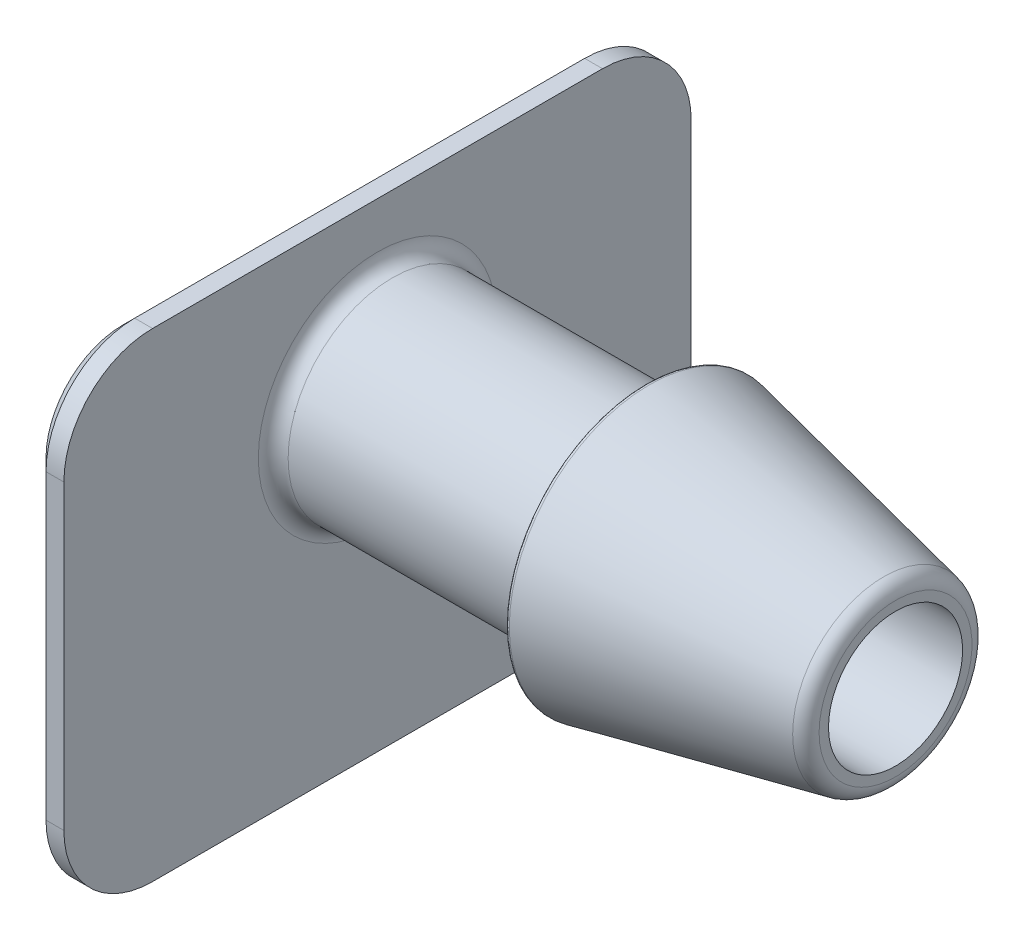
ISO-10303-21;
HEADER;
FILE_DESCRIPTION(('STEP AP214'),'2;1');
FILE_NAME('part.step','',(''),(''),'','','');
FILE_SCHEMA(('AUTOMOTIVE_DESIGN { 1 0 10303 214 1 1 1 1 }'));
ENDSEC;
DATA;
#1=APPLICATION_CONTEXT('core data for automotive mechanical design processes');
#2=APPLICATION_PROTOCOL_DEFINITION('international standard','automotive_design',2000,#1);
#3=PRODUCT_CONTEXT('',#1,'mechanical');
#4=PRODUCT('Part','Part','',(#3));
#5=PRODUCT_RELATED_PRODUCT_CATEGORY('part','',(#4));
#6=PRODUCT_DEFINITION_FORMATION('','',#4);
#7=PRODUCT_DEFINITION_CONTEXT('part definition',#1,'design');
#8=PRODUCT_DEFINITION('design','',#6,#7);
#9=PRODUCT_DEFINITION_SHAPE('','',#8);
#10=(LENGTH_UNIT() NAMED_UNIT(*) SI_UNIT(.MILLI.,.METRE.));
#11=(NAMED_UNIT(*) PLANE_ANGLE_UNIT() SI_UNIT($,.RADIAN.));
#12=(NAMED_UNIT(*) SI_UNIT($,.STERADIAN.) SOLID_ANGLE_UNIT());
#13=UNCERTAINTY_MEASURE_WITH_UNIT(LENGTH_MEASURE(1.E-05),#10,'distance_accuracy_value','');
#14=(GEOMETRIC_REPRESENTATION_CONTEXT(3) GLOBAL_UNCERTAINTY_ASSIGNED_CONTEXT((#13)) GLOBAL_UNIT_ASSIGNED_CONTEXT((#10,
#11,#12)) REPRESENTATION_CONTEXT('',''));
#15=CARTESIAN_POINT('',(0.,0.,0.));
#16=DIRECTION('',(0.,0.,1.));
#17=DIRECTION('',(1.,0.,0.));
#18=AXIS2_PLACEMENT_3D('',#15,#16,#17);
#19=CARTESIAN_POINT('',(1.80625,2.75,0.));
#20=DIRECTION('',(1.,0.,0.));
#21=DIRECTION('',(0.,0.,-1.));
#22=AXIS2_PLACEMENT_3D('',#19,#20,#21);
#23=PLANE('',#22);
#24=CARTESIAN_POINT('',(1.80625,-3.7747,-3.7747));
#25=DIRECTION('',(1.,0.,0.));
#26=DIRECTION('',(0.,0.,-1.));
#27=AXIS2_PLACEMENT_3D('',#24,#25,#26);
#28=CIRCLE('',#27,1.2875);
#29=CARTESIAN_POINT('',(1.80625,-3.77469999999999,-5.0622));
#30=VERTEX_POINT('',#29);
#31=CARTESIAN_POINT('',(1.80625,-5.0622,-3.77469999999999));
#32=VERTEX_POINT('',#31);
#33=EDGE_CURVE('E211',#30,#32,#28,.F.);
#34=ORIENTED_EDGE('',*,*,#33,.T.);
#35=DIRECTION('',(0.,0.,1.));
#36=VECTOR('',#35,1.);
#37=CARTESIAN_POINT('',(1.80625,-5.0622,3.77469999999999));
#38=LINE('',#37,#36);
#39=CARTESIAN_POINT('',(1.80625,-5.0622,3.77469999999999));
#40=VERTEX_POINT('',#39);
#41=EDGE_CURVE('E215',#32,#40,#38,.T.);
#42=ORIENTED_EDGE('',*,*,#41,.T.);
#43=CARTESIAN_POINT('',(1.80625,-3.7747,3.7747));
#44=DIRECTION('',(1.,0.,0.));
#45=DIRECTION('',(0.,0.,-1.));
#46=AXIS2_PLACEMENT_3D('',#43,#44,#45);
#47=CIRCLE('',#46,1.2875);
#48=CARTESIAN_POINT('',(1.80625,-3.77469999999999,5.0622));
#49=VERTEX_POINT('',#48);
#50=EDGE_CURVE('E213',#40,#49,#47,.F.);
#51=ORIENTED_EDGE('',*,*,#50,.T.);
#52=DIRECTION('',(0.,1.,0.));
#53=VECTOR('',#52,1.);
#54=CARTESIAN_POINT('',(1.80625,1.28749999999999,5.0622));
#55=LINE('',#54,#53);
#56=CARTESIAN_POINT('',(1.80625,1.28749999999999,5.0622));
#57=VERTEX_POINT('',#56);
#58=EDGE_CURVE('E209',#49,#57,#55,.T.);
#59=ORIENTED_EDGE('',*,*,#58,.T.);
#60=CARTESIAN_POINT('',(1.80625,1.2875,3.7747));
#61=DIRECTION('',(1.,0.,0.));
#62=DIRECTION('',(0.,0.,-1.));
#63=AXIS2_PLACEMENT_3D('',#60,#61,#62);
#64=CIRCLE('',#63,1.2875);
#65=CARTESIAN_POINT('',(1.80625,2.575,3.77469999999999));
#66=VERTEX_POINT('',#65);
#67=EDGE_CURVE('E205',#57,#66,#64,.F.);
#68=ORIENTED_EDGE('',*,*,#67,.T.);
#69=DIRECTION('',(0.,0.,-1.));
#70=VECTOR('',#69,1.);
#71=CARTESIAN_POINT('',(1.80625,2.575,-3.77469999999999));
#72=LINE('',#71,#70);
#73=CARTESIAN_POINT('',(1.80625,2.575,-3.77469999999999));
#74=VERTEX_POINT('',#73);
#75=EDGE_CURVE('E201',#66,#74,#72,.T.);
#76=ORIENTED_EDGE('',*,*,#75,.T.);
#77=CARTESIAN_POINT('',(1.80625,1.2875,-3.7747));
#78=DIRECTION('',(1.,0.,0.));
#79=DIRECTION('',(0.,0.,-1.));
#80=AXIS2_PLACEMENT_3D('',#77,#78,#79);
#81=CIRCLE('',#80,1.2875);
#82=CARTESIAN_POINT('',(1.80625,1.28749999999999,-5.0622));
#83=VERTEX_POINT('',#82);
#84=EDGE_CURVE('E203',#74,#83,#81,.F.);
#85=ORIENTED_EDGE('',*,*,#84,.T.);
#86=DIRECTION('',(0.,-1.,0.));
#87=VECTOR('',#86,1.);
#88=CARTESIAN_POINT('',(1.80625,-3.7747,-5.0622));
#89=LINE('',#88,#87);
#90=EDGE_CURVE('E207',#83,#30,#89,.T.);
#91=ORIENTED_EDGE('',*,*,#90,.T.);
#92=EDGE_LOOP('',(#34,#42,#51,#59,#68,#76,#85,#91));
#93=FACE_BOUND('',#92,.T.);
#94=CARTESIAN_POINT('',(1.80625,0.,0.));
#95=DIRECTION('',(-1.,0.,0.));
#96=DIRECTION('',(0.,0.,1.));
#97=AXIS2_PLACEMENT_3D('',#94,#95,#96);
#98=CIRCLE('',#97,1.49176203549763);
#99=CARTESIAN_POINT('',(1.80625,0.,1.49176203549763));
#100=VERTEX_POINT('',#99);
#101=EDGE_CURVE('E198',#100,#100,#98,.T.);
#102=ORIENTED_EDGE('',*,*,#101,.F.);
#103=EDGE_LOOP('',(#102));
#104=FACE_BOUND('',#103,.T.);
#105=ADVANCED_FACE('F30',(#93,#104),#23,.F.);
#106=CARTESIAN_POINT('',(1.80625,0.,0.));
#107=DIRECTION('',(-1.,0.,0.));
#108=DIRECTION('',(0.,0.,1.));
#109=AXIS2_PLACEMENT_3D('',#106,#107,#108);
#110=CONICAL_SURFACE('',#109,1.49176203549763,0.349065850398867);
#111=CARTESIAN_POINT('',(2.81392041084295,0.,0.));
#112=DIRECTION('',(-1.,0.,0.));
#113=DIRECTION('',(0.,0.,1.));
#114=AXIS2_PLACEMENT_3D('',#111,#112,#113);
#115=CIRCLE('',#114,1.125);
#116=CARTESIAN_POINT('',(2.81392041084295,0.,1.125));
#117=VERTEX_POINT('',#116);
#118=EDGE_CURVE('E195',#117,#117,#115,.T.);
#119=ORIENTED_EDGE('',*,*,#118,.F.);
#120=EDGE_LOOP('',(#119));
#121=FACE_BOUND('',#120,.T.);
#122=ORIENTED_EDGE('',*,*,#101,.T.);
#123=EDGE_LOOP('',(#122));
#124=FACE_BOUND('',#123,.T.);
#125=ADVANCED_FACE('F309',(#121,#124),#110,.F.);
#126=CARTESIAN_POINT('',(0.,0.,0.));
#127=DIRECTION('',(-1.,0.,0.));
#128=DIRECTION('',(0.,0.,1.));
#129=AXIS2_PLACEMENT_3D('',#126,#127,#128);
#130=CYLINDRICAL_SURFACE('',#129,1.125);
#131=CARTESIAN_POINT('',(10.99725,0.,0.));
#132=DIRECTION('',(-1.,0.,0.));
#133=DIRECTION('',(0.,0.,1.));
#134=AXIS2_PLACEMENT_3D('',#131,#132,#133);
#135=CIRCLE('',#134,1.125);
#136=CARTESIAN_POINT('',(10.99725,0.,1.125));
#137=VERTEX_POINT('',#136);
#138=EDGE_CURVE('E192',#137,#137,#135,.T.);
#139=ORIENTED_EDGE('',*,*,#138,.F.);
#140=EDGE_LOOP('',(#139));
#141=FACE_BOUND('',#140,.T.);
#142=ORIENTED_EDGE('',*,*,#118,.T.);
#143=EDGE_LOOP('',(#142));
#144=FACE_BOUND('',#143,.T.);
#145=ADVANCED_FACE('F316',(#141,#144),#130,.F.);
#146=CARTESIAN_POINT('',(10.99725,1.125,0.));
#147=DIRECTION('',(-1.,0.,0.));
#148=DIRECTION('',(0.,0.,1.));
#149=AXIS2_PLACEMENT_3D('',#146,#147,#148);
#150=PLANE('',#149);
#151=CARTESIAN_POINT('',(10.99725,0.,0.));
#152=DIRECTION('',(-1.,0.,0.));
#153=DIRECTION('',(0.,0.,1.));
#154=AXIS2_PLACEMENT_3D('',#151,#152,#153);
#155=CIRCLE('',#154,1.2827663099365);
#156=CARTESIAN_POINT('',(10.99725,0.,1.2827663099365));
#157=VERTEX_POINT('',#156);
#158=EDGE_CURVE('E189',#157,#157,#155,.T.);
#159=ORIENTED_EDGE('',*,*,#158,.F.);
#160=EDGE_LOOP('',(#159));
#161=FACE_BOUND('',#160,.T.);
#162=ORIENTED_EDGE('',*,*,#138,.T.);
#163=EDGE_LOOP('',(#162));
#164=FACE_BOUND('',#163,.T.);
#165=ADVANCED_FACE('F461',(#161,#164),#150,.F.);
#166=CARTESIAN_POINT('',(10.74725,0.,0.));
#167=DIRECTION('',(-1.,0.,0.));
#168=DIRECTION('',(0.,0.,1.));
#169=AXIS2_PLACEMENT_3D('',#166,#167,#168);
#170=TOROIDAL_SURFACE('',#169,1.2827663099365,0.25);
#171=CARTESIAN_POINT('',(10.7984162234429,0.,0.));
#172=DIRECTION('',(-1.,0.,0.));
#173=DIRECTION('',(0.,0.,1.));
#174=AXIS2_PLACEMENT_3D('',#171,#172,#173);
#175=CIRCLE('',#174,1.5274743350983);
#176=CARTESIAN_POINT('',(10.7984162234429,0.,1.5274743350983));
#177=VERTEX_POINT('',#176);
#178=EDGE_CURVE('E186',#177,#177,#175,.T.);
#179=ORIENTED_EDGE('',*,*,#178,.F.);
#180=EDGE_LOOP('',(#179));
#181=FACE_BOUND('',#180,.T.);
#182=ORIENTED_EDGE('',*,*,#158,.T.);
#183=EDGE_LOOP('',(#182));
#184=FACE_BOUND('',#183,.T.);
#185=ADVANCED_FACE('F468',(#181,#184),#170,.T.);
#186=CARTESIAN_POINT('',(10.7984162234429,0.,0.));
#187=DIRECTION('',(-1.,0.,0.));
#188=DIRECTION('',(0.,0.,1.));
#189=AXIS2_PLACEMENT_3D('',#186,#187,#188);
#190=CONICAL_SURFACE('',#189,1.5274743350983,0.206121341875306);
#191=CARTESIAN_POINT('',(6.86648324468858,0.,0.));
#192=DIRECTION('',(-1.,0.,0.));
#193=DIRECTION('',(0.,0.,1.));
#194=AXIS2_PLACEMENT_3D('',#191,#192,#193);
#195=CIRCLE('',#194,2.34960577611056);
#196=CARTESIAN_POINT('',(6.86648324468858,0.,2.34960577611056));
#197=VERTEX_POINT('',#196);
#198=EDGE_CURVE('E183',#197,#197,#195,.T.);
#199=ORIENTED_EDGE('',*,*,#198,.F.);
#200=EDGE_LOOP('',(#199));
#201=FACE_BOUND('',#200,.T.);
#202=ORIENTED_EDGE('',*,*,#178,.T.);
#203=EDGE_LOOP('',(#202));
#204=FACE_BOUND('',#203,.T.);
#205=ADVANCED_FACE('F476',(#201,#204),#190,.T.);
#206=CARTESIAN_POINT('',(6.85625,0.,0.));
#207=DIRECTION('',(-1.,0.,0.));
#208=DIRECTION('',(0.,0.,1.));
#209=AXIS2_PLACEMENT_3D('',#206,#207,#208);
#210=TOROIDAL_SURFACE('',#209,2.3006641710782,0.0499999999999998);
#211=CARTESIAN_POINT('',(6.80625,0.,0.));
#212=DIRECTION('',(-1.,0.,0.));
#213=DIRECTION('',(0.,0.,1.));
#214=AXIS2_PLACEMENT_3D('',#211,#212,#213);
#215=CIRCLE('',#214,2.3006641710782);
#216=CARTESIAN_POINT('',(6.80625,0.,2.3006641710782));
#217=VERTEX_POINT('',#216);
#218=EDGE_CURVE('E180',#217,#217,#215,.T.);
#219=ORIENTED_EDGE('',*,*,#218,.F.);
#220=EDGE_LOOP('',(#219));
#221=FACE_BOUND('',#220,.T.);
#222=ORIENTED_EDGE('',*,*,#198,.T.);
#223=EDGE_LOOP('',(#222));
#224=FACE_BOUND('',#223,.T.);
#225=ADVANCED_FACE('F484',(#221,#224),#210,.T.);
#226=CARTESIAN_POINT('',(6.80625,2.3006641710782,0.));
#227=DIRECTION('',(1.,0.,0.));
#228=DIRECTION('',(0.,0.,-1.));
#229=AXIS2_PLACEMENT_3D('',#226,#227,#228);
#230=PLANE('',#229);
#231=CARTESIAN_POINT('',(6.80625,0.,0.));
#232=DIRECTION('',(-1.,0.,0.));
#233=DIRECTION('',(0.,0.,1.));
#234=AXIS2_PLACEMENT_3D('',#231,#232,#233);
#235=CIRCLE('',#234,2.);
#236=CARTESIAN_POINT('',(6.80625,0.,2.));
#237=VERTEX_POINT('',#236);
#238=EDGE_CURVE('E177',#237,#237,#235,.T.);
#239=ORIENTED_EDGE('',*,*,#238,.F.);
#240=EDGE_LOOP('',(#239));
#241=FACE_BOUND('',#240,.T.);
#242=ORIENTED_EDGE('',*,*,#218,.T.);
#243=EDGE_LOOP('',(#242));
#244=FACE_BOUND('',#243,.T.);
#245=ADVANCED_FACE('F492',(#241,#244),#230,.F.);
#246=CARTESIAN_POINT('',(6.55625,0.,0.));
#247=DIRECTION('',(-1.,0.,0.));
#248=DIRECTION('',(0.,0.,1.));
#249=AXIS2_PLACEMENT_3D('',#246,#247,#248);
#250=TOROIDAL_SURFACE('',#249,2.,0.25);
#251=CARTESIAN_POINT('',(6.55625,0.,0.));
#252=DIRECTION('',(-1.,0.,0.));
#253=DIRECTION('',(0.,0.,1.));
#254=AXIS2_PLACEMENT_3D('',#251,#252,#253);
#255=CIRCLE('',#254,1.75);
#256=CARTESIAN_POINT('',(6.55625,0.,1.75));
#257=VERTEX_POINT('',#256);
#258=EDGE_CURVE('E174',#257,#257,#255,.T.);
#259=ORIENTED_EDGE('',*,*,#258,.F.);
#260=EDGE_LOOP('',(#259));
#261=FACE_BOUND('',#260,.T.);
#262=ORIENTED_EDGE('',*,*,#238,.T.);
#263=EDGE_LOOP('',(#262));
#264=FACE_BOUND('',#263,.T.);
#265=ADVANCED_FACE('F500',(#261,#264),#250,.F.);
#266=CARTESIAN_POINT('',(0.,0.,0.));
#267=DIRECTION('',(-1.,0.,0.));
#268=DIRECTION('',(0.,0.,1.));
#269=AXIS2_PLACEMENT_3D('',#266,#267,#268);
#270=CYLINDRICAL_SURFACE('',#269,1.75);
#271=CARTESIAN_POINT('',(2.55625,0.,0.));
#272=DIRECTION('',(-1.,0.,0.));
#273=DIRECTION('',(0.,0.,1.));
#274=AXIS2_PLACEMENT_3D('',#271,#272,#273);
#275=CIRCLE('',#274,1.75);
#276=CARTESIAN_POINT('',(2.55625,0.,1.75));
#277=VERTEX_POINT('',#276);
#278=EDGE_CURVE('E171',#277,#277,#275,.T.);
#279=ORIENTED_EDGE('',*,*,#278,.F.);
#280=EDGE_LOOP('',(#279));
#281=FACE_BOUND('',#280,.T.);
#282=ORIENTED_EDGE('',*,*,#258,.T.);
#283=EDGE_LOOP('',(#282));
#284=FACE_BOUND('',#283,.T.);
#285=ADVANCED_FACE('F508',(#281,#284),#270,.T.);
#286=CARTESIAN_POINT('',(2.55625,0.,0.));
#287=DIRECTION('',(-1.,0.,0.));
#288=DIRECTION('',(0.,0.,1.));
#289=AXIS2_PLACEMENT_3D('',#286,#287,#288);
#290=TOROIDAL_SURFACE('',#289,2.,0.25);
#291=CARTESIAN_POINT('',(2.30625,0.,0.));
#292=DIRECTION('',(-1.,0.,0.));
#293=DIRECTION('',(0.,0.,1.));
#294=AXIS2_PLACEMENT_3D('',#291,#292,#293);
#295=CIRCLE('',#294,2.);
#296=CARTESIAN_POINT('',(2.30625,0.,2.));
#297=VERTEX_POINT('',#296);
#298=EDGE_CURVE('E157',#297,#297,#295,.T.);
#299=ORIENTED_EDGE('',*,*,#298,.F.);
#300=EDGE_LOOP('',(#299));
#301=FACE_BOUND('',#300,.T.);
#302=ORIENTED_EDGE('',*,*,#278,.T.);
#303=EDGE_LOOP('',(#302));
#304=FACE_BOUND('',#303,.T.);
#305=ADVANCED_FACE('F440',(#301,#304),#290,.F.);
#306=CARTESIAN_POINT('',(2.30625,2.,0.));
#307=DIRECTION('',(-1.,0.,0.));
#308=DIRECTION('',(0.,0.,1.));
#309=AXIS2_PLACEMENT_3D('',#306,#307,#308);
#310=PLANE('',#309);
#311=CARTESIAN_POINT('',(2.30625,1.2875,-3.7747));
#312=DIRECTION('',(1.,0.,0.));
#313=DIRECTION('',(0.,0.,1.));
#314=AXIS2_PLACEMENT_3D('',#311,#312,#313);
#315=CIRCLE('',#314,1.4875);
#316=CARTESIAN_POINT('',(2.30625,1.28749999999999,-5.2622));
#317=VERTEX_POINT('',#316);
#318=CARTESIAN_POINT('',(2.30625,2.775,-3.77469999999999));
#319=VERTEX_POINT('',#318);
#320=EDGE_CURVE('E121',#317,#319,#315,.T.);
#321=ORIENTED_EDGE('',*,*,#320,.T.);
#322=DIRECTION('',(0.,0.,1.));
#323=VECTOR('',#322,1.);
#324=CARTESIAN_POINT('',(2.30625,2.775,3.77469999999999));
#325=LINE('',#324,#323);
#326=CARTESIAN_POINT('',(2.30625,2.775,3.77469999999999));
#327=VERTEX_POINT('',#326);
#328=EDGE_CURVE('E127',#319,#327,#325,.T.);
#329=ORIENTED_EDGE('',*,*,#328,.T.);
#330=CARTESIAN_POINT('',(2.30625,1.2875,3.7747));
#331=DIRECTION('',(1.,0.,0.));
#332=DIRECTION('',(0.,0.,1.));
#333=AXIS2_PLACEMENT_3D('',#330,#331,#332);
#334=CIRCLE('',#333,1.4875);
#335=CARTESIAN_POINT('',(2.30625,1.28749999999999,5.2622));
#336=VERTEX_POINT('',#335);
#337=EDGE_CURVE('E132',#327,#336,#334,.T.);
#338=ORIENTED_EDGE('',*,*,#337,.T.);
#339=DIRECTION('',(0.,-1.,0.));
#340=VECTOR('',#339,1.);
#341=CARTESIAN_POINT('',(2.30625,1.28749999999999,5.2622));
#342=LINE('',#341,#340);
#343=CARTESIAN_POINT('',(2.30625,-3.77469999999999,5.2622));
#344=VERTEX_POINT('',#343);
#345=EDGE_CURVE('E143',#336,#344,#342,.T.);
#346=ORIENTED_EDGE('',*,*,#345,.T.);
#347=CARTESIAN_POINT('',(2.30625,-3.7747,3.7747));
#348=DIRECTION('',(1.,0.,0.));
#349=DIRECTION('',(0.,0.,1.));
#350=AXIS2_PLACEMENT_3D('',#347,#348,#349);
#351=CIRCLE('',#350,1.4875);
#352=CARTESIAN_POINT('',(2.30625,-5.2622,3.77469999999999));
#353=VERTEX_POINT('',#352);
#354=EDGE_CURVE('E146',#344,#353,#351,.T.);
#355=ORIENTED_EDGE('',*,*,#354,.T.);
#356=DIRECTION('',(0.,0.,-1.));
#357=VECTOR('',#356,1.);
#358=CARTESIAN_POINT('',(2.30625,-5.2622,3.77469999999999));
#359=LINE('',#358,#357);
#360=CARTESIAN_POINT('',(2.30625,-5.2622,-3.77469999999999));
#361=VERTEX_POINT('',#360);
#362=EDGE_CURVE('E149',#353,#361,#359,.T.);
#363=ORIENTED_EDGE('',*,*,#362,.T.);
#364=CARTESIAN_POINT('',(2.30625,-3.7747,-3.7747));
#365=DIRECTION('',(1.,0.,0.));
#366=DIRECTION('',(0.,0.,1.));
#367=AXIS2_PLACEMENT_3D('',#364,#365,#366);
#368=CIRCLE('',#367,1.4875);
#369=CARTESIAN_POINT('',(2.30625,-3.77469999999999,-5.2622));
#370=VERTEX_POINT('',#369);
#371=EDGE_CURVE('E152',#361,#370,#368,.T.);
#372=ORIENTED_EDGE('',*,*,#371,.T.);
#373=DIRECTION('',(0.,1.,0.));
#374=VECTOR('',#373,1.);
#375=CARTESIAN_POINT('',(2.30625,1.28749999999999,-5.2622));
#376=LINE('',#375,#374);
#377=EDGE_CURVE('E124',#370,#317,#376,.T.);
#378=ORIENTED_EDGE('',*,*,#377,.T.);
#379=EDGE_LOOP('',(#321,#329,#338,#346,#355,#363,#372,#378));
#380=FACE_BOUND('',#379,.T.);
#381=ORIENTED_EDGE('',*,*,#298,.T.);
#382=EDGE_LOOP('',(#381));
#383=FACE_BOUND('',#382,.T.);
#384=ADVANCED_FACE('F134',(#380,#383),#310,.F.);
#385=CARTESIAN_POINT('',(-11.4360903973769,2.775,3.77469999999999));
#386=DIRECTION('',(0.,1.,0.));
#387=DIRECTION('',(0.,0.,1.));
#388=AXIS2_PLACEMENT_3D('',#385,#386,#387);
#389=PLANE('',#388);
#390=DIRECTION('',(1.,0.,0.));
#391=VECTOR('',#390,1.);
#392=CARTESIAN_POINT('',(-11.4360903973769,2.775,-3.77469999999999));
#393=LINE('',#392,#391);
#394=CARTESIAN_POINT('',(2.00625,2.775,-3.77469999999999));
#395=VERTEX_POINT('',#394);
#396=EDGE_CURVE('E117',#395,#319,#393,.T.);
#397=ORIENTED_EDGE('',*,*,#396,.F.);
#398=DIRECTION('',(0.,0.,1.));
#399=VECTOR('',#398,1.);
#400=CARTESIAN_POINT('',(2.00625,2.775,3.77469999999999));
#401=LINE('',#400,#399);
#402=CARTESIAN_POINT('',(2.00625,2.775,3.77469999999999));
#403=VERTEX_POINT('',#402);
#404=EDGE_CURVE('E11',#395,#403,#401,.T.);
#405=ORIENTED_EDGE('',*,*,#404,.T.);
#406=DIRECTION('',(1.,0.,0.));
#407=VECTOR('',#406,1.);
#408=CARTESIAN_POINT('',(-11.4360903973769,2.775,3.77469999999999));
#409=LINE('',#408,#407);
#410=EDGE_CURVE('E123',#403,#327,#409,.T.);
#411=ORIENTED_EDGE('',*,*,#410,.T.);
#412=ORIENTED_EDGE('',*,*,#328,.F.);
#413=EDGE_LOOP('',(#397,#405,#411,#412));
#414=FACE_BOUND('',#413,.T.);
#415=ADVANCED_FACE('F128',(#414),#389,.T.);
#416=CARTESIAN_POINT('',(-11.4360903973769,1.2875,3.7747));
#417=DIRECTION('',(1.,0.,0.));
#418=DIRECTION('',(0.,0.,-1.));
#419=AXIS2_PLACEMENT_3D('',#416,#417,#418);
#420=CYLINDRICAL_SURFACE('',#419,1.4875);
#421=ORIENTED_EDGE('',*,*,#410,.F.);
#422=CARTESIAN_POINT('',(2.00625,1.2875,3.7747));
#423=DIRECTION('',(1.,0.,0.));
#424=DIRECTION('',(0.,0.,-1.));
#425=AXIS2_PLACEMENT_3D('',#422,#423,#424);
#426=CIRCLE('',#425,1.4875);
#427=CARTESIAN_POINT('',(2.00625,1.28749999999999,5.2622));
#428=VERTEX_POINT('',#427);
#429=EDGE_CURVE('E229',#403,#428,#426,.T.);
#430=ORIENTED_EDGE('',*,*,#429,.T.);
#431=DIRECTION('',(1.,0.,0.));
#432=VECTOR('',#431,1.);
#433=CARTESIAN_POINT('',(-11.4360903973769,1.28749999999999,5.2622));
#434=LINE('',#433,#432);
#435=EDGE_CURVE('E166',#428,#336,#434,.T.);
#436=ORIENTED_EDGE('',*,*,#435,.T.);
#437=ORIENTED_EDGE('',*,*,#337,.F.);
#438=EDGE_LOOP('',(#421,#430,#436,#437));
#439=FACE_BOUND('',#438,.T.);
#440=ADVANCED_FACE('F417',(#439),#420,.T.);
#441=CARTESIAN_POINT('',(-11.4360903973769,1.28749999999999,5.2622));
#442=DIRECTION('',(0.,0.,1.));
#443=DIRECTION('',(0.,-1.,0.));
#444=AXIS2_PLACEMENT_3D('',#441,#442,#443);
#445=PLANE('',#444);
#446=ORIENTED_EDGE('',*,*,#435,.F.);
#447=DIRECTION('',(0.,-1.,0.));
#448=VECTOR('',#447,1.);
#449=CARTESIAN_POINT('',(2.00625,-3.77469999999999,5.2622));
#450=LINE('',#449,#448);
#451=CARTESIAN_POINT('',(2.00625,-3.77469999999999,5.2622));
#452=VERTEX_POINT('',#451);
#453=EDGE_CURVE('E225',#428,#452,#450,.T.);
#454=ORIENTED_EDGE('',*,*,#453,.T.);
#455=DIRECTION('',(1.,0.,0.));
#456=VECTOR('',#455,1.);
#457=CARTESIAN_POINT('',(-11.4360903973769,-3.77469999999999,5.2622));
#458=LINE('',#457,#456);
#459=EDGE_CURVE('E164',#452,#344,#458,.T.);
#460=ORIENTED_EDGE('',*,*,#459,.T.);
#461=ORIENTED_EDGE('',*,*,#345,.F.);
#462=EDGE_LOOP('',(#446,#454,#460,#461));
#463=FACE_BOUND('',#462,.T.);
#464=ADVANCED_FACE('F409',(#463),#445,.T.);
#465=CARTESIAN_POINT('',(-11.4360903973769,-3.7747,3.7747));
#466=DIRECTION('',(1.,0.,0.));
#467=DIRECTION('',(0.,0.,-1.));
#468=AXIS2_PLACEMENT_3D('',#465,#466,#467);
#469=CYLINDRICAL_SURFACE('',#468,1.4875);
#470=ORIENTED_EDGE('',*,*,#459,.F.);
#471=CARTESIAN_POINT('',(2.00625,-3.7747,3.7747));
#472=DIRECTION('',(1.,0.,0.));
#473=DIRECTION('',(0.,0.,-1.));
#474=AXIS2_PLACEMENT_3D('',#471,#472,#473);
#475=CIRCLE('',#474,1.4875);
#476=CARTESIAN_POINT('',(2.00625,-5.2622,3.77469999999999));
#477=VERTEX_POINT('',#476);
#478=EDGE_CURVE('E221',#452,#477,#475,.T.);
#479=ORIENTED_EDGE('',*,*,#478,.T.);
#480=DIRECTION('',(1.,0.,0.));
#481=VECTOR('',#480,1.);
#482=CARTESIAN_POINT('',(-11.4360903973769,-5.2622,3.77469999999999));
#483=LINE('',#482,#481);
#484=EDGE_CURVE('E162',#477,#353,#483,.T.);
#485=ORIENTED_EDGE('',*,*,#484,.T.);
#486=ORIENTED_EDGE('',*,*,#354,.F.);
#487=EDGE_LOOP('',(#470,#479,#485,#486));
#488=FACE_BOUND('',#487,.T.);
#489=ADVANCED_FACE('F274',(#488),#469,.T.);
#490=CARTESIAN_POINT('',(-11.4360903973769,-5.2622,3.77469999999999));
#491=DIRECTION('',(0.,-1.,0.));
#492=DIRECTION('',(0.,0.,-1.));
#493=AXIS2_PLACEMENT_3D('',#490,#491,#492);
#494=PLANE('',#493);
#495=ORIENTED_EDGE('',*,*,#484,.F.);
#496=DIRECTION('',(0.,0.,-1.));
#497=VECTOR('',#496,1.);
#498=CARTESIAN_POINT('',(2.00625,-5.2622,-3.77469999999999));
#499=LINE('',#498,#497);
#500=CARTESIAN_POINT('',(2.00625,-5.2622,-3.77469999999999));
#501=VERTEX_POINT('',#500);
#502=EDGE_CURVE('E218',#477,#501,#499,.T.);
#503=ORIENTED_EDGE('',*,*,#502,.T.);
#504=DIRECTION('',(1.,0.,0.));
#505=VECTOR('',#504,1.);
#506=CARTESIAN_POINT('',(-11.4360903973769,-5.2622,-3.77469999999999));
#507=LINE('',#506,#505);
#508=EDGE_CURVE('E160',#501,#361,#507,.T.);
#509=ORIENTED_EDGE('',*,*,#508,.T.);
#510=ORIENTED_EDGE('',*,*,#362,.F.);
#511=EDGE_LOOP('',(#495,#503,#509,#510));
#512=FACE_BOUND('',#511,.T.);
#513=ADVANCED_FACE('F279',(#512),#494,.T.);
#514=CARTESIAN_POINT('',(-11.4360903973769,-3.7747,-3.7747));
#515=DIRECTION('',(1.,0.,0.));
#516=DIRECTION('',(0.,0.,-1.));
#517=AXIS2_PLACEMENT_3D('',#514,#515,#516);
#518=CYLINDRICAL_SURFACE('',#517,1.4875);
#519=ORIENTED_EDGE('',*,*,#508,.F.);
#520=CARTESIAN_POINT('',(2.00625,-3.7747,-3.7747));
#521=DIRECTION('',(1.,0.,0.));
#522=DIRECTION('',(0.,0.,-1.));
#523=AXIS2_PLACEMENT_3D('',#520,#521,#522);
#524=CIRCLE('',#523,1.4875);
#525=CARTESIAN_POINT('',(2.00625,-3.77469999999999,-5.2622));
#526=VERTEX_POINT('',#525);
#527=EDGE_CURVE('E223',#501,#526,#524,.T.);
#528=ORIENTED_EDGE('',*,*,#527,.T.);
#529=DIRECTION('',(1.,0.,0.));
#530=VECTOR('',#529,1.);
#531=CARTESIAN_POINT('',(-11.4360903973769,-3.77469999999999,-5.2622));
#532=LINE('',#531,#530);
#533=EDGE_CURVE('E158',#526,#370,#532,.T.);
#534=ORIENTED_EDGE('',*,*,#533,.T.);
#535=ORIENTED_EDGE('',*,*,#371,.F.);
#536=EDGE_LOOP('',(#519,#528,#534,#535));
#537=FACE_BOUND('',#536,.T.);
#538=ADVANCED_FACE('F292',(#537),#518,.T.);
#539=CARTESIAN_POINT('',(-11.4360903973769,1.28749999999999,-5.2622));
#540=DIRECTION('',(0.,0.,-1.));
#541=DIRECTION('',(0.,1.,0.));
#542=AXIS2_PLACEMENT_3D('',#539,#540,#541);
#543=PLANE('',#542);
#544=ORIENTED_EDGE('',*,*,#533,.F.);
#545=DIRECTION('',(0.,1.,0.));
#546=VECTOR('',#545,1.);
#547=CARTESIAN_POINT('',(2.00625,1.28749999999999,-5.2622));
#548=LINE('',#547,#546);
#549=CARTESIAN_POINT('',(2.00625,1.28749999999999,-5.2622));
#550=VERTEX_POINT('',#549);
#551=EDGE_CURVE('E227',#526,#550,#548,.T.);
#552=ORIENTED_EDGE('',*,*,#551,.T.);
#553=DIRECTION('',(1.,0.,0.));
#554=VECTOR('',#553,1.);
#555=CARTESIAN_POINT('',(-11.4360903973769,1.28749999999999,-5.2622));
#556=LINE('',#555,#554);
#557=EDGE_CURVE('E155',#550,#317,#556,.T.);
#558=ORIENTED_EDGE('',*,*,#557,.T.);
#559=ORIENTED_EDGE('',*,*,#377,.F.);
#560=EDGE_LOOP('',(#544,#552,#558,#559));
#561=FACE_BOUND('',#560,.T.);
#562=ADVANCED_FACE('F296',(#561),#543,.T.);
#563=CARTESIAN_POINT('',(-11.4360903973769,1.2875,-3.7747));
#564=DIRECTION('',(1.,0.,0.));
#565=DIRECTION('',(0.,0.,-1.));
#566=AXIS2_PLACEMENT_3D('',#563,#564,#565);
#567=CYLINDRICAL_SURFACE('',#566,1.4875);
#568=ORIENTED_EDGE('',*,*,#557,.F.);
#569=CARTESIAN_POINT('',(2.00625,1.2875,-3.7747));
#570=DIRECTION('',(1.,0.,0.));
#571=DIRECTION('',(0.,0.,-1.));
#572=AXIS2_PLACEMENT_3D('',#569,#570,#571);
#573=CIRCLE('',#572,1.4875);
#574=EDGE_CURVE('E39',#550,#395,#573,.T.);
#575=ORIENTED_EDGE('',*,*,#574,.T.);
#576=ORIENTED_EDGE('',*,*,#396,.T.);
#577=ORIENTED_EDGE('',*,*,#320,.F.);
#578=EDGE_LOOP('',(#568,#575,#576,#577));
#579=FACE_BOUND('',#578,.T.);
#580=ADVANCED_FACE('F119',(#579),#567,.T.);
#581=CARTESIAN_POINT('',(1.80625,2.575,0.));
#582=DIRECTION('',(-0.707106781186546,0.707106781186549,0.));
#583=DIRECTION('',(-0.707106781186549,-0.707106781186546,0.));
#584=AXIS2_PLACEMENT_3D('',#581,#582,#583);
#585=PLANE('',#584);
#586=DIRECTION('',(-0.707106781186549,-0.707106781186546,0.));
#587=VECTOR('',#586,1.);
#588=CARTESIAN_POINT('',(2.00625,2.775,3.77469999999999));
#589=LINE('',#588,#587);
#590=EDGE_CURVE('E140',#403,#66,#589,.T.);
#591=ORIENTED_EDGE('',*,*,#590,.F.);
#592=ORIENTED_EDGE('',*,*,#404,.F.);
#593=DIRECTION('',(0.707106781186549,0.707106781186546,0.));
#594=VECTOR('',#593,1.);
#595=CARTESIAN_POINT('',(1.80625,2.575,-3.77469999999999));
#596=LINE('',#595,#594);
#597=EDGE_CURVE('E34',#74,#395,#596,.T.);
#598=ORIENTED_EDGE('',*,*,#597,.F.);
#599=ORIENTED_EDGE('',*,*,#75,.F.);
#600=EDGE_LOOP('',(#591,#592,#598,#599));
#601=FACE_BOUND('',#600,.T.);
#602=ADVANCED_FACE('F32',(#601),#585,.T.);
#603=CARTESIAN_POINT('',(1.80625,1.2875,-3.7747));
#604=DIRECTION('',(1.,0.,0.));
#605=DIRECTION('',(0.,0.,-1.));
#606=AXIS2_PLACEMENT_3D('',#603,#604,#605);
#607=CONICAL_SURFACE('',#606,1.2875,0.785398163397444);
#608=ORIENTED_EDGE('',*,*,#597,.T.);
#609=ORIENTED_EDGE('',*,*,#574,.F.);
#610=DIRECTION('',(0.707106781186551,0.,-0.707106781186544));
#611=VECTOR('',#610,1.);
#612=CARTESIAN_POINT('',(1.80625,1.28749999999999,-5.0622));
#613=LINE('',#612,#611);
#614=EDGE_CURVE('E245',#83,#550,#613,.T.);
#615=ORIENTED_EDGE('',*,*,#614,.F.);
#616=ORIENTED_EDGE('',*,*,#84,.F.);
#617=EDGE_LOOP('',(#608,#609,#615,#616));
#618=FACE_BOUND('',#617,.T.);
#619=ADVANCED_FACE('F301',(#618),#607,.T.);
#620=CARTESIAN_POINT('',(1.80625,1.2875,3.7747));
#621=DIRECTION('',(1.,0.,0.));
#622=DIRECTION('',(0.,0.,-1.));
#623=AXIS2_PLACEMENT_3D('',#620,#621,#622);
#624=CONICAL_SURFACE('',#623,1.2875,0.785398163397443);
#625=ORIENTED_EDGE('',*,*,#590,.T.);
#626=ORIENTED_EDGE('',*,*,#67,.F.);
#627=DIRECTION('',(-0.707106781186551,0.,-0.707106781186544));
#628=VECTOR('',#627,1.);
#629=CARTESIAN_POINT('',(2.00625,1.28749999999999,5.2622));
#630=LINE('',#629,#628);
#631=EDGE_CURVE('E242',#428,#57,#630,.T.);
#632=ORIENTED_EDGE('',*,*,#631,.F.);
#633=ORIENTED_EDGE('',*,*,#429,.F.);
#634=EDGE_LOOP('',(#625,#626,#632,#633));
#635=FACE_BOUND('',#634,.T.);
#636=ADVANCED_FACE('F252',(#635),#624,.T.);
#637=CARTESIAN_POINT('',(1.80625,2.75,-5.0622));
#638=DIRECTION('',(-0.707106781186545,0.,-0.707106781186549));
#639=DIRECTION('',(-0.70710678118655,0.,0.707106781186546));
#640=AXIS2_PLACEMENT_3D('',#637,#638,#639);
#641=PLANE('',#640);
#642=ORIENTED_EDGE('',*,*,#614,.T.);
#643=ORIENTED_EDGE('',*,*,#551,.F.);
#644=DIRECTION('',(0.707106781186549,0.,-0.707106781186546));
#645=VECTOR('',#644,1.);
#646=CARTESIAN_POINT('',(1.80625,-3.77469999999999,-5.0622));
#647=LINE('',#646,#645);
#648=EDGE_CURVE('E239',#30,#526,#647,.T.);
#649=ORIENTED_EDGE('',*,*,#648,.F.);
#650=ORIENTED_EDGE('',*,*,#90,.F.);
#651=EDGE_LOOP('',(#642,#643,#649,#650));
#652=FACE_BOUND('',#651,.T.);
#653=ADVANCED_FACE('F298',(#652),#641,.T.);
#654=CARTESIAN_POINT('',(1.80625,2.75,5.0622));
#655=DIRECTION('',(-0.707106781186545,0.,0.707106781186549));
#656=DIRECTION('',(0.70710678118655,0.,0.707106781186546));
#657=AXIS2_PLACEMENT_3D('',#654,#655,#656);
#658=PLANE('',#657);
#659=ORIENTED_EDGE('',*,*,#631,.T.);
#660=ORIENTED_EDGE('',*,*,#58,.F.);
#661=DIRECTION('',(-0.707106781186549,0.,-0.707106781186546));
#662=VECTOR('',#661,1.);
#663=CARTESIAN_POINT('',(2.00625,-3.77469999999999,5.2622));
#664=LINE('',#663,#662);
#665=EDGE_CURVE('E236',#452,#49,#664,.T.);
#666=ORIENTED_EDGE('',*,*,#665,.F.);
#667=ORIENTED_EDGE('',*,*,#453,.F.);
#668=EDGE_LOOP('',(#659,#660,#666,#667));
#669=FACE_BOUND('',#668,.T.);
#670=ADVANCED_FACE('F265',(#669),#658,.T.);
#671=CARTESIAN_POINT('',(1.80625,-3.7747,-3.7747));
#672=DIRECTION('',(1.,0.,0.));
#673=DIRECTION('',(0.,0.,-1.));
#674=AXIS2_PLACEMENT_3D('',#671,#672,#673);
#675=CONICAL_SURFACE('',#674,1.2875,0.785398163397445);
#676=ORIENTED_EDGE('',*,*,#648,.T.);
#677=ORIENTED_EDGE('',*,*,#527,.F.);
#678=DIRECTION('',(0.707106781186551,-0.707106781186544,0.));
#679=VECTOR('',#678,1.);
#680=CARTESIAN_POINT('',(1.80625,-5.0622,-3.77469999999999));
#681=LINE('',#680,#679);
#682=EDGE_CURVE('E234',#32,#501,#681,.T.);
#683=ORIENTED_EDGE('',*,*,#682,.F.);
#684=ORIENTED_EDGE('',*,*,#33,.F.);
#685=EDGE_LOOP('',(#676,#677,#683,#684));
#686=FACE_BOUND('',#685,.T.);
#687=ADVANCED_FACE('F288',(#686),#675,.T.);
#688=CARTESIAN_POINT('',(1.80625,-3.7747,3.7747));
#689=DIRECTION('',(1.,0.,0.));
#690=DIRECTION('',(0.,0.,-1.));
#691=AXIS2_PLACEMENT_3D('',#688,#689,#690);
#692=CONICAL_SURFACE('',#691,1.2875,0.785398163397444);
#693=ORIENTED_EDGE('',*,*,#665,.T.);
#694=ORIENTED_EDGE('',*,*,#50,.F.);
#695=DIRECTION('',(-0.707106781186551,0.707106781186544,0.));
#696=VECTOR('',#695,1.);
#697=CARTESIAN_POINT('',(2.00625,-5.2622,3.77469999999999));
#698=LINE('',#697,#696);
#699=EDGE_CURVE('E232',#477,#40,#698,.T.);
#700=ORIENTED_EDGE('',*,*,#699,.F.);
#701=ORIENTED_EDGE('',*,*,#478,.F.);
#702=EDGE_LOOP('',(#693,#694,#700,#701));
#703=FACE_BOUND('',#702,.T.);
#704=ADVANCED_FACE('F269',(#703),#692,.T.);
#705=CARTESIAN_POINT('',(1.80625,-5.0622,0.));
#706=DIRECTION('',(-0.707106781186546,-0.707106781186549,0.));
#707=DIRECTION('',(0.707106781186549,-0.707106781186546,0.));
#708=AXIS2_PLACEMENT_3D('',#705,#706,#707);
#709=PLANE('',#708);
#710=ORIENTED_EDGE('',*,*,#682,.T.);
#711=ORIENTED_EDGE('',*,*,#502,.F.);
#712=ORIENTED_EDGE('',*,*,#699,.T.);
#713=ORIENTED_EDGE('',*,*,#41,.F.);
#714=EDGE_LOOP('',(#710,#711,#712,#713));
#715=FACE_BOUND('',#714,.T.);
#716=ADVANCED_FACE('F282',(#715),#709,.T.);
#717=CLOSED_SHELL('',(#105,#125,#145,#165,#185,#205,#225,#245,#265,#285,#305,#384,#415,#440,
#464,#489,#513,#538,#562,#580,#602,#619,#636,#653,#670,#687,#704,#716));
#718=MANIFOLD_SOLID_BREP('B2',#717);
#719=ADVANCED_BREP_SHAPE_REPRESENTATION('',(#18,#718),#14);
#720=SHAPE_DEFINITION_REPRESENTATION(#9,#719);
ENDSEC;
END-ISO-10303-21;
